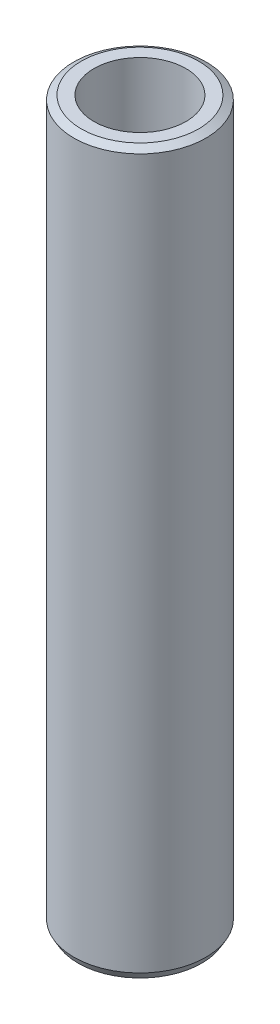
ISO-10303-21;
HEADER;
FILE_DESCRIPTION(('STEP AP214'),'2;1');
FILE_NAME('part.step','',(''),(''),'','','');
FILE_SCHEMA(('AUTOMOTIVE_DESIGN { 1 0 10303 214 1 1 1 1 }'));
ENDSEC;
DATA;
#1=APPLICATION_CONTEXT('core data for automotive mechanical design processes');
#2=APPLICATION_PROTOCOL_DEFINITION('international standard','automotive_design',2000,#1);
#3=PRODUCT_CONTEXT('',#1,'mechanical');
#4=PRODUCT('Part','Part','',(#3));
#5=PRODUCT_RELATED_PRODUCT_CATEGORY('part','',(#4));
#6=PRODUCT_DEFINITION_FORMATION('','',#4);
#7=PRODUCT_DEFINITION_CONTEXT('part definition',#1,'design');
#8=PRODUCT_DEFINITION('design','',#6,#7);
#9=PRODUCT_DEFINITION_SHAPE('','',#8);
#10=(LENGTH_UNIT() NAMED_UNIT(*) SI_UNIT(.MILLI.,.METRE.));
#11=(NAMED_UNIT(*) PLANE_ANGLE_UNIT() SI_UNIT($,.RADIAN.));
#12=(NAMED_UNIT(*) SI_UNIT($,.STERADIAN.) SOLID_ANGLE_UNIT());
#13=UNCERTAINTY_MEASURE_WITH_UNIT(LENGTH_MEASURE(1.E-05),#10,'distance_accuracy_value','');
#14=(GEOMETRIC_REPRESENTATION_CONTEXT(3) GLOBAL_UNCERTAINTY_ASSIGNED_CONTEXT((#13)) GLOBAL_UNIT_ASSIGNED_CONTEXT((#10,
#11,#12)) REPRESENTATION_CONTEXT('',''));
#15=CARTESIAN_POINT('',(0.,0.,0.));
#16=DIRECTION('',(0.,0.,1.));
#17=DIRECTION('',(1.,0.,0.));
#18=AXIS2_PLACEMENT_3D('',#15,#16,#17);
#19=CARTESIAN_POINT('',(0.,600.,0.));
#20=DIRECTION('',(0.,-1.,0.));
#21=DIRECTION('',(0.,0.,-1.));
#22=AXIS2_PLACEMENT_3D('',#19,#20,#21);
#23=CYLINDRICAL_SURFACE('',#22,55.);
#24=CARTESIAN_POINT('',(0.,596.454308887605,0.));
#25=DIRECTION('',(0.,1.,0.));
#26=DIRECTION('',(0.,0.,1.));
#27=AXIS2_PLACEMENT_3D('',#24,#25,#26);
#28=CIRCLE('',#27,55.);
#29=CARTESIAN_POINT('',(0.,596.454308887605,55.));
#30=VERTEX_POINT('',#29);
#31=EDGE_CURVE('E50',#30,#30,#28,.F.);
#32=ORIENTED_EDGE('',*,*,#31,.T.);
#33=EDGE_LOOP('',(#32));
#34=FACE_BOUND('',#33,.T.);
#35=CARTESIAN_POINT('',(0.,6.14131715461297,0.));
#36=DIRECTION('',(0.,1.,0.));
#37=DIRECTION('',(0.,0.,1.));
#38=AXIS2_PLACEMENT_3D('',#35,#36,#37);
#39=CIRCLE('',#38,55.);
#40=CARTESIAN_POINT('',(0.,6.14131715461297,55.));
#41=VERTEX_POINT('',#40);
#42=EDGE_CURVE('E51',#41,#41,#39,.T.);
#43=ORIENTED_EDGE('',*,*,#42,.T.);
#44=EDGE_LOOP('',(#43));
#45=FACE_BOUND('',#44,.T.);
#46=ADVANCED_FACE('F39',(#34,#45),#23,.T.);
#47=CARTESIAN_POINT('',(0.,600.,0.));
#48=DIRECTION('',(0.,1.,0.));
#49=DIRECTION('',(0.,0.,1.));
#50=AXIS2_PLACEMENT_3D('',#47,#48,#49);
#51=PLANE('',#50);
#52=CARTESIAN_POINT('',(0.,600.,0.));
#53=DIRECTION('',(0.,1.,0.));
#54=DIRECTION('',(0.,0.,1.));
#55=AXIS2_PLACEMENT_3D('',#52,#53,#54);
#56=CIRCLE('',#55,48.8586828453871);
#57=CARTESIAN_POINT('',(0.,600.,48.8586828453871));
#58=VERTEX_POINT('',#57);
#59=EDGE_CURVE('E54',#58,#58,#56,.T.);
#60=ORIENTED_EDGE('',*,*,#59,.T.);
#61=EDGE_LOOP('',(#60));
#62=FACE_BOUND('',#61,.T.);
#63=CARTESIAN_POINT('',(0.,600.,0.));
#64=DIRECTION('',(0.,1.,0.));
#65=DIRECTION('',(0.,0.,1.));
#66=AXIS2_PLACEMENT_3D('',#63,#64,#65);
#67=CIRCLE('',#66,38.265946333229);
#68=CARTESIAN_POINT('',(0.,600.,38.265946333229));
#69=VERTEX_POINT('',#68);
#70=EDGE_CURVE('E58',#69,#69,#67,.T.);
#71=ORIENTED_EDGE('',*,*,#70,.F.);
#72=EDGE_LOOP('',(#71));
#73=FACE_BOUND('',#72,.T.);
#74=ADVANCED_FACE('F69',(#62,#73),#51,.T.);
#75=CARTESIAN_POINT('',(0.,0.,0.));
#76=DIRECTION('',(0.,1.,0.));
#77=DIRECTION('',(0.,0.,1.));
#78=AXIS2_PLACEMENT_3D('',#75,#76,#77);
#79=PLANE('',#78);
#80=CARTESIAN_POINT('',(0.,0.,0.));
#81=DIRECTION('',(0.,1.,0.));
#82=DIRECTION('',(0.,0.,1.));
#83=AXIS2_PLACEMENT_3D('',#80,#81,#82);
#84=CIRCLE('',#83,51.4543088876053);
#85=CARTESIAN_POINT('',(0.,0.,51.4543088876053));
#86=VERTEX_POINT('',#85);
#87=EDGE_CURVE('E10',#86,#86,#84,.F.);
#88=ORIENTED_EDGE('',*,*,#87,.T.);
#89=EDGE_LOOP('',(#88));
#90=FACE_BOUND('',#89,.T.);
#91=CARTESIAN_POINT('',(0.,0.,0.));
#92=DIRECTION('',(0.,1.,0.));
#93=DIRECTION('',(0.,0.,1.));
#94=AXIS2_PLACEMENT_3D('',#91,#92,#93);
#95=CIRCLE('',#94,38.265946333229);
#96=CARTESIAN_POINT('',(0.,0.,38.265946333229));
#97=VERTEX_POINT('',#96);
#98=EDGE_CURVE('E63',#97,#97,#95,.T.);
#99=ORIENTED_EDGE('',*,*,#98,.T.);
#100=EDGE_LOOP('',(#99));
#101=FACE_BOUND('',#100,.T.);
#102=ADVANCED_FACE('F75',(#90,#101),#79,.F.);
#103=CARTESIAN_POINT('',(0.,600.,0.));
#104=DIRECTION('',(0.,-1.,0.));
#105=DIRECTION('',(0.,0.,-1.));
#106=AXIS2_PLACEMENT_3D('',#103,#104,#105);
#107=CYLINDRICAL_SURFACE('',#106,38.265946333229);
#108=ORIENTED_EDGE('',*,*,#70,.T.);
#109=EDGE_LOOP('',(#108));
#110=FACE_BOUND('',#109,.T.);
#111=ORIENTED_EDGE('',*,*,#98,.F.);
#112=EDGE_LOOP('',(#111));
#113=FACE_BOUND('',#112,.T.);
#114=ADVANCED_FACE('F70',(#110,#113),#107,.F.);
#115=CARTESIAN_POINT('',(0.,600.,0.));
#116=DIRECTION('',(0.,-1.,0.));
#117=DIRECTION('',(0.,0.,-1.));
#118=AXIS2_PLACEMENT_3D('',#115,#116,#117);
#119=CONICAL_SURFACE('',#118,48.8586828453871,1.04719755119659);
#120=ORIENTED_EDGE('',*,*,#31,.F.);
#121=EDGE_LOOP('',(#120));
#122=FACE_BOUND('',#121,.T.);
#123=ORIENTED_EDGE('',*,*,#59,.F.);
#124=EDGE_LOOP('',(#123));
#125=FACE_BOUND('',#124,.T.);
#126=ADVANCED_FACE('F81',(#122,#125),#119,.T.);
#127=CARTESIAN_POINT('',(0.,6.14131715461297,0.));
#128=DIRECTION('',(0.,1.,0.));
#129=DIRECTION('',(0.,0.,1.));
#130=AXIS2_PLACEMENT_3D('',#127,#128,#129);
#131=CONICAL_SURFACE('',#130,55.,0.5235987755983);
#132=ORIENTED_EDGE('',*,*,#87,.F.);
#133=EDGE_LOOP('',(#132));
#134=FACE_BOUND('',#133,.T.);
#135=ORIENTED_EDGE('',*,*,#42,.F.);
#136=EDGE_LOOP('',(#135));
#137=FACE_BOUND('',#136,.T.);
#138=ADVANCED_FACE('F45',(#134,#137),#131,.T.);
#139=CLOSED_SHELL('',(#46,#74,#102,#114,#126,#138));
#140=MANIFOLD_SOLID_BREP('B2',#139);
#141=ADVANCED_BREP_SHAPE_REPRESENTATION('',(#18,#140),#14);
#142=SHAPE_DEFINITION_REPRESENTATION(#9,#141);
ENDSEC;
END-ISO-10303-21;
